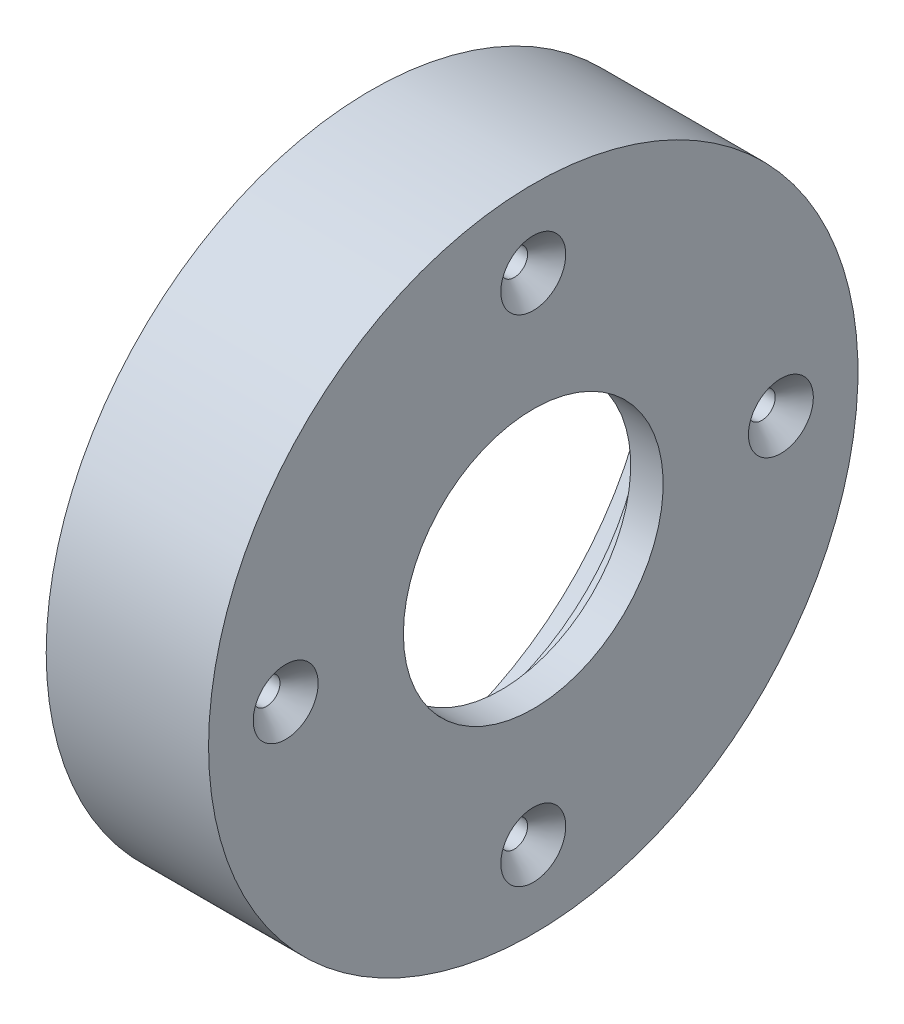
ISO-10303-21;
HEADER;
FILE_DESCRIPTION(('STEP AP214'),'2;1');
FILE_NAME('part.step','',(''),(''),'','','');
FILE_SCHEMA(('AUTOMOTIVE_DESIGN { 1 0 10303 214 1 1 1 1 }'));
ENDSEC;
DATA;
#1=APPLICATION_CONTEXT('core data for automotive mechanical design processes');
#2=APPLICATION_PROTOCOL_DEFINITION('international standard','automotive_design',2000,#1);
#3=PRODUCT_CONTEXT('',#1,'mechanical');
#4=PRODUCT('Part','Part','',(#3));
#5=PRODUCT_RELATED_PRODUCT_CATEGORY('part','',(#4));
#6=PRODUCT_DEFINITION_FORMATION('','',#4);
#7=PRODUCT_DEFINITION_CONTEXT('part definition',#1,'design');
#8=PRODUCT_DEFINITION('design','',#6,#7);
#9=PRODUCT_DEFINITION_SHAPE('','',#8);
#10=(LENGTH_UNIT() NAMED_UNIT(*) SI_UNIT(.MILLI.,.METRE.));
#11=(NAMED_UNIT(*) PLANE_ANGLE_UNIT() SI_UNIT($,.RADIAN.));
#12=(NAMED_UNIT(*) SI_UNIT($,.STERADIAN.) SOLID_ANGLE_UNIT());
#13=UNCERTAINTY_MEASURE_WITH_UNIT(LENGTH_MEASURE(1.E-05),#10,'distance_accuracy_value','');
#14=(GEOMETRIC_REPRESENTATION_CONTEXT(3) GLOBAL_UNCERTAINTY_ASSIGNED_CONTEXT((#13)) GLOBAL_UNIT_ASSIGNED_CONTEXT((#10,
#11,#12)) REPRESENTATION_CONTEXT('',''));
#15=CARTESIAN_POINT('',(0.,0.,0.));
#16=DIRECTION('',(0.,0.,1.));
#17=DIRECTION('',(1.,0.,0.));
#18=AXIS2_PLACEMENT_3D('',#15,#16,#17);
#19=CARTESIAN_POINT('',(0.,23.5,0.));
#20=DIRECTION('',(1.,0.,0.));
#21=DIRECTION('',(0.,0.,-1.));
#22=AXIS2_PLACEMENT_3D('',#19,#20,#21);
#23=PLANE('',#22);
#24=CARTESIAN_POINT('',(0.,0.,0.));
#25=DIRECTION('',(-1.,0.,0.));
#26=DIRECTION('',(0.,0.,1.));
#27=AXIS2_PLACEMENT_3D('',#24,#25,#26);
#28=CIRCLE('',#27,21.);
#29=CARTESIAN_POINT('',(0.,0.,21.));
#30=VERTEX_POINT('',#29);
#31=EDGE_CURVE('E10',#30,#30,#28,.T.);
#32=ORIENTED_EDGE('',*,*,#31,.F.);
#33=EDGE_LOOP('',(#32));
#34=FACE_BOUND('',#33,.T.);
#35=CARTESIAN_POINT('',(0.,0.,0.));
#36=DIRECTION('',(-1.,0.,0.));
#37=DIRECTION('',(0.,0.,1.));
#38=AXIS2_PLACEMENT_3D('',#35,#36,#37);
#39=CIRCLE('',#38,23.5);
#40=CARTESIAN_POINT('',(0.,0.,23.5));
#41=VERTEX_POINT('',#40);
#42=EDGE_CURVE('E63',#41,#41,#39,.T.);
#43=ORIENTED_EDGE('',*,*,#42,.T.);
#44=EDGE_LOOP('',(#43));
#45=FACE_BOUND('',#44,.T.);
#46=ADVANCED_FACE('F41',(#34,#45),#23,.F.);
#47=CARTESIAN_POINT('',(-28.2244138714383,0.,0.));
#48=DIRECTION('',(-1.,0.,0.));
#49=DIRECTION('',(0.,0.,1.));
#50=AXIS2_PLACEMENT_3D('',#47,#48,#49);
#51=CYLINDRICAL_SURFACE('',#50,21.);
#52=CARTESIAN_POINT('',(2.,0.,0.));
#53=DIRECTION('',(-1.,0.,0.));
#54=DIRECTION('',(0.,0.,1.));
#55=AXIS2_PLACEMENT_3D('',#52,#53,#54);
#56=CIRCLE('',#55,21.);
#57=CARTESIAN_POINT('',(2.,0.,21.));
#58=VERTEX_POINT('',#57);
#59=EDGE_CURVE('E49',#58,#58,#56,.T.);
#60=ORIENTED_EDGE('',*,*,#59,.F.);
#61=EDGE_LOOP('',(#60));
#62=FACE_BOUND('',#61,.T.);
#63=ORIENTED_EDGE('',*,*,#31,.T.);
#64=EDGE_LOOP('',(#63));
#65=FACE_BOUND('',#64,.T.);
#66=ADVANCED_FACE('F135',(#62,#65),#51,.F.);
#67=CARTESIAN_POINT('',(2.,21.,0.));
#68=DIRECTION('',(1.,0.,0.));
#69=DIRECTION('',(0.,0.,-1.));
#70=AXIS2_PLACEMENT_3D('',#67,#68,#69);
#71=PLANE('',#70);
#72=CARTESIAN_POINT('',(2.,0.,0.));
#73=DIRECTION('',(-1.,0.,0.));
#74=DIRECTION('',(0.,0.,1.));
#75=AXIS2_PLACEMENT_3D('',#72,#73,#74);
#76=CIRCLE('',#75,16.);
#77=CARTESIAN_POINT('',(2.,0.,16.));
#78=VERTEX_POINT('',#77);
#79=EDGE_CURVE('E55',#78,#78,#76,.T.);
#80=ORIENTED_EDGE('',*,*,#79,.F.);
#81=EDGE_LOOP('',(#80));
#82=FACE_BOUND('',#81,.T.);
#83=ORIENTED_EDGE('',*,*,#59,.T.);
#84=EDGE_LOOP('',(#83));
#85=FACE_BOUND('',#84,.T.);
#86=ADVANCED_FACE('F132',(#82,#85),#71,.F.);
#87=CARTESIAN_POINT('',(-28.2244138714383,0.,0.));
#88=DIRECTION('',(-1.,0.,0.));
#89=DIRECTION('',(0.,0.,1.));
#90=AXIS2_PLACEMENT_3D('',#87,#88,#89);
#91=CYLINDRICAL_SURFACE('',#90,16.);
#92=CARTESIAN_POINT('',(6.,0.,0.));
#93=DIRECTION('',(-1.,0.,0.));
#94=DIRECTION('',(0.,0.,1.));
#95=AXIS2_PLACEMENT_3D('',#92,#93,#94);
#96=CIRCLE('',#95,16.);
#97=CARTESIAN_POINT('',(6.,0.,16.));
#98=VERTEX_POINT('',#97);
#99=EDGE_CURVE('E123',#98,#98,#96,.T.);
#100=ORIENTED_EDGE('',*,*,#99,.F.);
#101=EDGE_LOOP('',(#100));
#102=FACE_BOUND('',#101,.T.);
#103=ORIENTED_EDGE('',*,*,#79,.T.);
#104=EDGE_LOOP('',(#103));
#105=FACE_BOUND('',#104,.T.);
#106=ADVANCED_FACE('F130',(#102,#105),#91,.F.);
#107=CARTESIAN_POINT('',(6.,16.,0.));
#108=DIRECTION('',(-1.,0.,0.));
#109=DIRECTION('',(0.,0.,1.));
#110=AXIS2_PLACEMENT_3D('',#107,#108,#109);
#111=PLANE('',#110);
#112=CARTESIAN_POINT('',(6.,30.5,0.));
#113=DIRECTION('',(1.,0.,0.));
#114=DIRECTION('',(0.,0.,-1.));
#115=AXIS2_PLACEMENT_3D('',#112,#113,#114);
#116=CIRCLE('',#115,4.);
#117=CARTESIAN_POINT('',(6.,30.5,-4.));
#118=VERTEX_POINT('',#117);
#119=EDGE_CURVE('E210',#118,#118,#116,.T.);
#120=ORIENTED_EDGE('',*,*,#119,.F.);
#121=EDGE_LOOP('',(#120));
#122=FACE_BOUND('',#121,.T.);
#123=CARTESIAN_POINT('',(6.,0.,-30.5));
#124=DIRECTION('',(1.,0.,0.));
#125=DIRECTION('',(0.,0.,-1.));
#126=AXIS2_PLACEMENT_3D('',#123,#124,#125);
#127=CIRCLE('',#126,4.);
#128=CARTESIAN_POINT('',(6.,0.,-34.5));
#129=VERTEX_POINT('',#128);
#130=EDGE_CURVE('E82',#129,#129,#127,.T.);
#131=ORIENTED_EDGE('',*,*,#130,.F.);
#132=EDGE_LOOP('',(#131));
#133=FACE_BOUND('',#132,.T.);
#134=CARTESIAN_POINT('',(6.,-30.5,0.));
#135=DIRECTION('',(1.,0.,0.));
#136=DIRECTION('',(0.,0.,-1.));
#137=AXIS2_PLACEMENT_3D('',#134,#135,#136);
#138=CIRCLE('',#137,4.);
#139=CARTESIAN_POINT('',(6.,-30.5,-4.));
#140=VERTEX_POINT('',#139);
#141=EDGE_CURVE('E73',#140,#140,#138,.T.);
#142=ORIENTED_EDGE('',*,*,#141,.F.);
#143=EDGE_LOOP('',(#142));
#144=FACE_BOUND('',#143,.T.);
#145=CARTESIAN_POINT('',(6.,0.,30.5));
#146=DIRECTION('',(1.,0.,0.));
#147=DIRECTION('',(0.,0.,-1.));
#148=AXIS2_PLACEMENT_3D('',#145,#146,#147);
#149=CIRCLE('',#148,4.);
#150=CARTESIAN_POINT('',(6.,0.,26.5));
#151=VERTEX_POINT('',#150);
#152=EDGE_CURVE('E68',#151,#151,#149,.T.);
#153=ORIENTED_EDGE('',*,*,#152,.F.);
#154=EDGE_LOOP('',(#153));
#155=FACE_BOUND('',#154,.T.);
#156=CARTESIAN_POINT('',(6.,0.,0.));
#157=DIRECTION('',(-1.,0.,0.));
#158=DIRECTION('',(0.,0.,1.));
#159=AXIS2_PLACEMENT_3D('',#156,#157,#158);
#160=CIRCLE('',#159,40.);
#161=CARTESIAN_POINT('',(6.,0.,40.));
#162=VERTEX_POINT('',#161);
#163=EDGE_CURVE('E119',#162,#162,#160,.T.);
#164=ORIENTED_EDGE('',*,*,#163,.F.);
#165=EDGE_LOOP('',(#164));
#166=FACE_BOUND('',#165,.T.);
#167=ORIENTED_EDGE('',*,*,#99,.T.);
#168=EDGE_LOOP('',(#167));
#169=FACE_BOUND('',#168,.T.);
#170=ADVANCED_FACE('F147',(#122,#133,#144,#155,#166,#169),#111,.F.);
#171=CARTESIAN_POINT('',(-28.2244138714383,0.,0.));
#172=DIRECTION('',(-1.,0.,0.));
#173=DIRECTION('',(0.,0.,1.));
#174=AXIS2_PLACEMENT_3D('',#171,#172,#173);
#175=CYLINDRICAL_SURFACE('',#174,40.);
#176=CARTESIAN_POINT('',(-14.,0.,0.));
#177=DIRECTION('',(-1.,0.,0.));
#178=DIRECTION('',(0.,0.,1.));
#179=AXIS2_PLACEMENT_3D('',#176,#177,#178);
#180=CIRCLE('',#179,40.);
#181=CARTESIAN_POINT('',(-14.,0.,40.));
#182=VERTEX_POINT('',#181);
#183=EDGE_CURVE('E115',#182,#182,#180,.T.);
#184=ORIENTED_EDGE('',*,*,#183,.F.);
#185=EDGE_LOOP('',(#184));
#186=FACE_BOUND('',#185,.T.);
#187=ORIENTED_EDGE('',*,*,#163,.T.);
#188=EDGE_LOOP('',(#187));
#189=FACE_BOUND('',#188,.T.);
#190=ADVANCED_FACE('F151',(#186,#189),#175,.T.);
#191=CARTESIAN_POINT('',(-14.,40.,0.));
#192=DIRECTION('',(1.,0.,0.));
#193=DIRECTION('',(0.,0.,-1.));
#194=AXIS2_PLACEMENT_3D('',#191,#192,#193);
#195=PLANE('',#194);
#196=CARTESIAN_POINT('',(-14.,0.,0.));
#197=DIRECTION('',(-1.,0.,0.));
#198=DIRECTION('',(0.,0.,1.));
#199=AXIS2_PLACEMENT_3D('',#196,#197,#198);
#200=CIRCLE('',#199,35.);
#201=CARTESIAN_POINT('',(-14.,0.,35.));
#202=VERTEX_POINT('',#201);
#203=EDGE_CURVE('E111',#202,#202,#200,.T.);
#204=ORIENTED_EDGE('',*,*,#203,.F.);
#205=EDGE_LOOP('',(#204));
#206=FACE_BOUND('',#205,.T.);
#207=ORIENTED_EDGE('',*,*,#183,.T.);
#208=EDGE_LOOP('',(#207));
#209=FACE_BOUND('',#208,.T.);
#210=ADVANCED_FACE('F155',(#206,#209),#195,.F.);
#211=CARTESIAN_POINT('',(-28.2244138714383,0.,0.));
#212=DIRECTION('',(-1.,0.,0.));
#213=DIRECTION('',(0.,0.,1.));
#214=AXIS2_PLACEMENT_3D('',#211,#212,#213);
#215=CYLINDRICAL_SURFACE('',#214,35.);
#216=CARTESIAN_POINT('',(-4.,0.,0.));
#217=DIRECTION('',(-1.,0.,0.));
#218=DIRECTION('',(0.,0.,1.));
#219=AXIS2_PLACEMENT_3D('',#216,#217,#218);
#220=CIRCLE('',#219,35.);
#221=CARTESIAN_POINT('',(-4.,0.,35.));
#222=VERTEX_POINT('',#221);
#223=EDGE_CURVE('E107',#222,#222,#220,.T.);
#224=ORIENTED_EDGE('',*,*,#223,.F.);
#225=EDGE_LOOP('',(#224));
#226=FACE_BOUND('',#225,.T.);
#227=ORIENTED_EDGE('',*,*,#203,.T.);
#228=EDGE_LOOP('',(#227));
#229=FACE_BOUND('',#228,.T.);
#230=ADVANCED_FACE('F159',(#226,#229),#215,.F.);
#231=CARTESIAN_POINT('',(-4.,23.5,0.));
#232=DIRECTION('',(1.,0.,0.));
#233=DIRECTION('',(0.,0.,-1.));
#234=AXIS2_PLACEMENT_3D('',#231,#232,#233);
#235=PLANE('',#234);
#236=CARTESIAN_POINT('',(-4.,30.5,0.));
#237=DIRECTION('',(1.,0.,0.));
#238=DIRECTION('',(0.,0.,-1.));
#239=AXIS2_PLACEMENT_3D('',#236,#237,#238);
#240=CIRCLE('',#239,1.65);
#241=CARTESIAN_POINT('',(-4.,30.5,-1.65));
#242=VERTEX_POINT('',#241);
#243=EDGE_CURVE('E44',#242,#242,#240,.T.);
#244=ORIENTED_EDGE('',*,*,#243,.T.);
#245=EDGE_LOOP('',(#244));
#246=FACE_BOUND('',#245,.T.);
#247=CARTESIAN_POINT('',(-4.,0.,-30.5));
#248=DIRECTION('',(1.,0.,0.));
#249=DIRECTION('',(0.,0.,-1.));
#250=AXIS2_PLACEMENT_3D('',#247,#248,#249);
#251=CIRCLE('',#250,1.65);
#252=CARTESIAN_POINT('',(-4.,0.,-32.15));
#253=VERTEX_POINT('',#252);
#254=EDGE_CURVE('E70',#253,#253,#251,.T.);
#255=ORIENTED_EDGE('',*,*,#254,.T.);
#256=EDGE_LOOP('',(#255));
#257=FACE_BOUND('',#256,.T.);
#258=CARTESIAN_POINT('',(-4.,-30.5,0.));
#259=DIRECTION('',(1.,0.,0.));
#260=DIRECTION('',(0.,0.,-1.));
#261=AXIS2_PLACEMENT_3D('',#258,#259,#260);
#262=CIRCLE('',#261,1.65);
#263=CARTESIAN_POINT('',(-4.,-30.5,-1.65));
#264=VERTEX_POINT('',#263);
#265=EDGE_CURVE('E65',#264,#264,#262,.T.);
#266=ORIENTED_EDGE('',*,*,#265,.T.);
#267=EDGE_LOOP('',(#266));
#268=FACE_BOUND('',#267,.T.);
#269=CARTESIAN_POINT('',(-4.,0.,30.5));
#270=DIRECTION('',(1.,0.,0.));
#271=DIRECTION('',(0.,0.,-1.));
#272=AXIS2_PLACEMENT_3D('',#269,#270,#271);
#273=CIRCLE('',#272,1.65);
#274=CARTESIAN_POINT('',(-4.,0.,28.85));
#275=VERTEX_POINT('',#274);
#276=EDGE_CURVE('E59',#275,#275,#273,.T.);
#277=ORIENTED_EDGE('',*,*,#276,.T.);
#278=EDGE_LOOP('',(#277));
#279=FACE_BOUND('',#278,.T.);
#280=CARTESIAN_POINT('',(-4.,0.,0.));
#281=DIRECTION('',(-1.,0.,0.));
#282=DIRECTION('',(0.,0.,1.));
#283=AXIS2_PLACEMENT_3D('',#280,#281,#282);
#284=CIRCLE('',#283,23.5);
#285=CARTESIAN_POINT('',(-4.,0.,23.5));
#286=VERTEX_POINT('',#285);
#287=EDGE_CURVE('E103',#286,#286,#284,.T.);
#288=ORIENTED_EDGE('',*,*,#287,.F.);
#289=EDGE_LOOP('',(#288));
#290=FACE_BOUND('',#289,.T.);
#291=ORIENTED_EDGE('',*,*,#223,.T.);
#292=EDGE_LOOP('',(#291));
#293=FACE_BOUND('',#292,.T.);
#294=ADVANCED_FACE('F163',(#246,#257,#268,#279,#290,#293),#235,.F.);
#295=CARTESIAN_POINT('',(-28.2244138714383,0.,0.));
#296=DIRECTION('',(-1.,0.,0.));
#297=DIRECTION('',(0.,0.,1.));
#298=AXIS2_PLACEMENT_3D('',#295,#296,#297);
#299=CYLINDRICAL_SURFACE('',#298,23.5);
#300=ORIENTED_EDGE('',*,*,#42,.F.);
#301=EDGE_LOOP('',(#300));
#302=FACE_BOUND('',#301,.T.);
#303=ORIENTED_EDGE('',*,*,#287,.T.);
#304=EDGE_LOOP('',(#303));
#305=FACE_BOUND('',#304,.T.);
#306=ADVANCED_FACE('F167',(#302,#305),#299,.F.);
#307=CARTESIAN_POINT('',(6.,0.,30.5));
#308=DIRECTION('',(1.,0.,0.));
#309=DIRECTION('',(0.,0.,-1.));
#310=AXIS2_PLACEMENT_3D('',#307,#308,#309);
#311=CYLINDRICAL_SURFACE('',#310,1.65);
#312=CARTESIAN_POINT('',(3.65,0.,30.5));
#313=DIRECTION('',(1.,0.,0.));
#314=DIRECTION('',(0.,0.,-1.));
#315=AXIS2_PLACEMENT_3D('',#312,#313,#314);
#316=CIRCLE('',#315,1.65);
#317=CARTESIAN_POINT('',(3.65,0.,28.85));
#318=VERTEX_POINT('',#317);
#319=EDGE_CURVE('E64',#318,#318,#316,.T.);
#320=ORIENTED_EDGE('',*,*,#319,.T.);
#321=EDGE_LOOP('',(#320));
#322=FACE_BOUND('',#321,.T.);
#323=ORIENTED_EDGE('',*,*,#276,.F.);
#324=EDGE_LOOP('',(#323));
#325=FACE_BOUND('',#324,.T.);
#326=ADVANCED_FACE('F171',(#322,#325),#311,.F.);
#327=CARTESIAN_POINT('',(6.,0.,30.5));
#328=DIRECTION('',(1.,0.,0.));
#329=DIRECTION('',(0.,0.,-1.));
#330=AXIS2_PLACEMENT_3D('',#327,#328,#329);
#331=CONICAL_SURFACE('',#330,4.,0.785398163397449);
#332=ORIENTED_EDGE('',*,*,#319,.F.);
#333=EDGE_LOOP('',(#332));
#334=FACE_BOUND('',#333,.T.);
#335=ORIENTED_EDGE('',*,*,#152,.T.);
#336=EDGE_LOOP('',(#335));
#337=FACE_BOUND('',#336,.T.);
#338=ADVANCED_FACE('F175',(#334,#337),#331,.F.);
#339=CARTESIAN_POINT('',(6.,-30.5,0.));
#340=DIRECTION('',(1.,0.,0.));
#341=DIRECTION('',(0.,0.,-1.));
#342=AXIS2_PLACEMENT_3D('',#339,#340,#341);
#343=CYLINDRICAL_SURFACE('',#342,1.65);
#344=CARTESIAN_POINT('',(3.65,-30.5,0.));
#345=DIRECTION('',(1.,0.,0.));
#346=DIRECTION('',(0.,0.,-1.));
#347=AXIS2_PLACEMENT_3D('',#344,#345,#346);
#348=CIRCLE('',#347,1.65);
#349=CARTESIAN_POINT('',(3.65,-30.5,-1.65));
#350=VERTEX_POINT('',#349);
#351=EDGE_CURVE('E69',#350,#350,#348,.T.);
#352=ORIENTED_EDGE('',*,*,#351,.T.);
#353=EDGE_LOOP('',(#352));
#354=FACE_BOUND('',#353,.T.);
#355=ORIENTED_EDGE('',*,*,#265,.F.);
#356=EDGE_LOOP('',(#355));
#357=FACE_BOUND('',#356,.T.);
#358=ADVANCED_FACE('F179',(#354,#357),#343,.F.);
#359=CARTESIAN_POINT('',(6.,-30.5,0.));
#360=DIRECTION('',(1.,0.,0.));
#361=DIRECTION('',(0.,0.,-1.));
#362=AXIS2_PLACEMENT_3D('',#359,#360,#361);
#363=CONICAL_SURFACE('',#362,4.,0.785398163397448);
#364=ORIENTED_EDGE('',*,*,#351,.F.);
#365=EDGE_LOOP('',(#364));
#366=FACE_BOUND('',#365,.T.);
#367=ORIENTED_EDGE('',*,*,#141,.T.);
#368=EDGE_LOOP('',(#367));
#369=FACE_BOUND('',#368,.T.);
#370=ADVANCED_FACE('F183',(#366,#369),#363,.F.);
#371=CARTESIAN_POINT('',(6.,0.,-30.5));
#372=DIRECTION('',(1.,0.,0.));
#373=DIRECTION('',(0.,0.,-1.));
#374=AXIS2_PLACEMENT_3D('',#371,#372,#373);
#375=CYLINDRICAL_SURFACE('',#374,1.65);
#376=CARTESIAN_POINT('',(3.65,0.,-30.5));
#377=DIRECTION('',(1.,0.,0.));
#378=DIRECTION('',(0.,0.,-1.));
#379=AXIS2_PLACEMENT_3D('',#376,#377,#378);
#380=CIRCLE('',#379,1.65);
#381=CARTESIAN_POINT('',(3.65,0.,-32.15));
#382=VERTEX_POINT('',#381);
#383=EDGE_CURVE('E74',#382,#382,#380,.T.);
#384=ORIENTED_EDGE('',*,*,#383,.T.);
#385=EDGE_LOOP('',(#384));
#386=FACE_BOUND('',#385,.T.);
#387=ORIENTED_EDGE('',*,*,#254,.F.);
#388=EDGE_LOOP('',(#387));
#389=FACE_BOUND('',#388,.T.);
#390=ADVANCED_FACE('F187',(#386,#389),#375,.F.);
#391=CARTESIAN_POINT('',(6.,0.,-30.5));
#392=DIRECTION('',(1.,0.,0.));
#393=DIRECTION('',(0.,0.,-1.));
#394=AXIS2_PLACEMENT_3D('',#391,#392,#393);
#395=CONICAL_SURFACE('',#394,4.,0.785398163397449);
#396=ORIENTED_EDGE('',*,*,#383,.F.);
#397=EDGE_LOOP('',(#396));
#398=FACE_BOUND('',#397,.T.);
#399=ORIENTED_EDGE('',*,*,#130,.T.);
#400=EDGE_LOOP('',(#399));
#401=FACE_BOUND('',#400,.T.);
#402=ADVANCED_FACE('F191',(#398,#401),#395,.F.);
#403=CARTESIAN_POINT('',(6.,30.5,0.));
#404=DIRECTION('',(1.,0.,0.));
#405=DIRECTION('',(0.,0.,-1.));
#406=AXIS2_PLACEMENT_3D('',#403,#404,#405);
#407=CYLINDRICAL_SURFACE('',#406,1.65);
#408=CARTESIAN_POINT('',(3.65,30.5,0.));
#409=DIRECTION('',(1.,0.,0.));
#410=DIRECTION('',(0.,0.,-1.));
#411=AXIS2_PLACEMENT_3D('',#408,#409,#410);
#412=CIRCLE('',#411,1.65);
#413=CARTESIAN_POINT('',(3.65,30.5,-1.65));
#414=VERTEX_POINT('',#413);
#415=EDGE_CURVE('E207',#414,#414,#412,.T.);
#416=ORIENTED_EDGE('',*,*,#415,.T.);
#417=EDGE_LOOP('',(#416));
#418=FACE_BOUND('',#417,.T.);
#419=ORIENTED_EDGE('',*,*,#243,.F.);
#420=EDGE_LOOP('',(#419));
#421=FACE_BOUND('',#420,.T.);
#422=ADVANCED_FACE('F194',(#418,#421),#407,.F.);
#423=CARTESIAN_POINT('',(6.,30.5,0.));
#424=DIRECTION('',(1.,0.,0.));
#425=DIRECTION('',(0.,0.,-1.));
#426=AXIS2_PLACEMENT_3D('',#423,#424,#425);
#427=CONICAL_SURFACE('',#426,4.,0.785398163397449);
#428=ORIENTED_EDGE('',*,*,#415,.F.);
#429=EDGE_LOOP('',(#428));
#430=FACE_BOUND('',#429,.T.);
#431=ORIENTED_EDGE('',*,*,#119,.T.);
#432=EDGE_LOOP('',(#431));
#433=FACE_BOUND('',#432,.T.);
#434=ADVANCED_FACE('F198',(#430,#433),#427,.F.);
#435=CLOSED_SHELL('',(#46,#66,#86,#106,#170,#190,#210,#230,#294,#306,#326,#338,#358,#370,#390,
#402,#422,#434));
#436=MANIFOLD_SOLID_BREP('B2',#435);
#437=ADVANCED_BREP_SHAPE_REPRESENTATION('',(#18,#436),#14);
#438=SHAPE_DEFINITION_REPRESENTATION(#9,#437);
ENDSEC;
END-ISO-10303-21;
